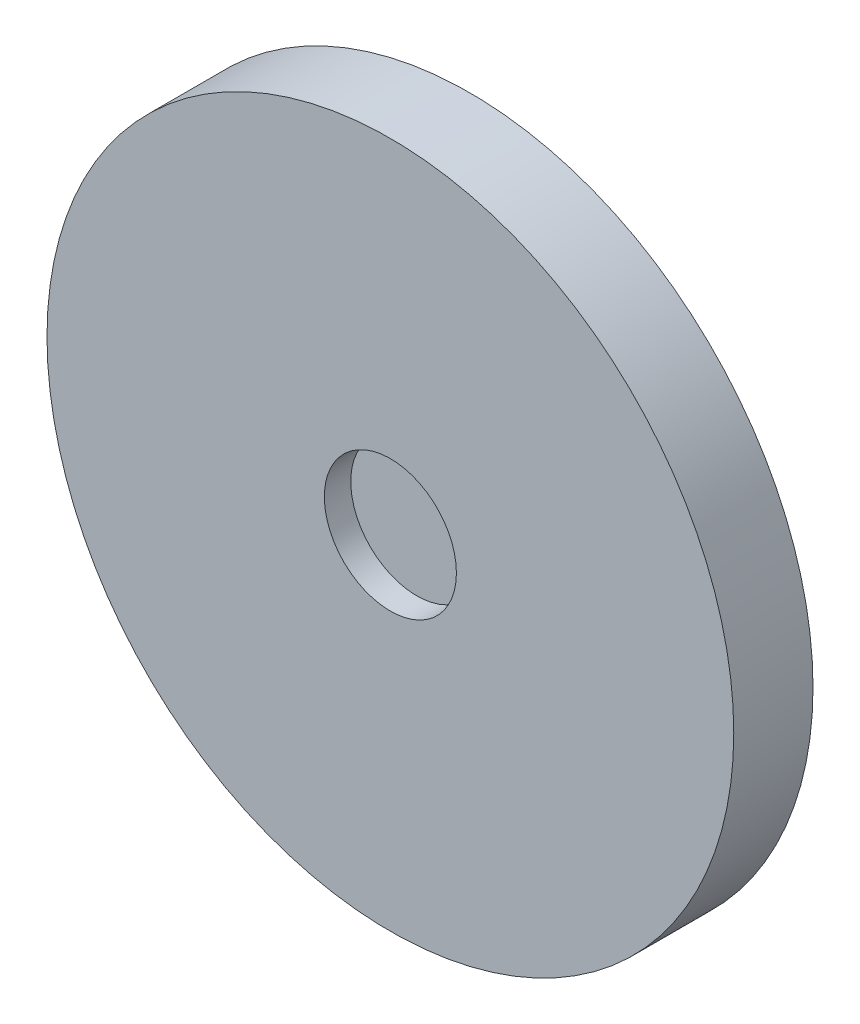
ISO-10303-21;
HEADER;
FILE_DESCRIPTION(('STEP AP214'),'2;1');
FILE_NAME('part.step','',(''),(''),'','','');
FILE_SCHEMA(('AUTOMOTIVE_DESIGN { 1 0 10303 214 1 1 1 1 }'));
ENDSEC;
DATA;
#1=APPLICATION_CONTEXT('core data for automotive mechanical design processes');
#2=APPLICATION_PROTOCOL_DEFINITION('international standard','automotive_design',2000,#1);
#3=PRODUCT_CONTEXT('',#1,'mechanical');
#4=PRODUCT('Part','Part','',(#3));
#5=PRODUCT_RELATED_PRODUCT_CATEGORY('part','',(#4));
#6=PRODUCT_DEFINITION_FORMATION('','',#4);
#7=PRODUCT_DEFINITION_CONTEXT('part definition',#1,'design');
#8=PRODUCT_DEFINITION('design','',#6,#7);
#9=PRODUCT_DEFINITION_SHAPE('','',#8);
#10=(LENGTH_UNIT() NAMED_UNIT(*) SI_UNIT(.MILLI.,.METRE.));
#11=(NAMED_UNIT(*) PLANE_ANGLE_UNIT() SI_UNIT($,.RADIAN.));
#12=(NAMED_UNIT(*) SI_UNIT($,.STERADIAN.) SOLID_ANGLE_UNIT());
#13=UNCERTAINTY_MEASURE_WITH_UNIT(LENGTH_MEASURE(1.E-05),#10,'distance_accuracy_value','');
#14=(GEOMETRIC_REPRESENTATION_CONTEXT(3) GLOBAL_UNCERTAINTY_ASSIGNED_CONTEXT((#13)) GLOBAL_UNIT_ASSIGNED_CONTEXT((#10,
#11,#12)) REPRESENTATION_CONTEXT('',''));
#15=CARTESIAN_POINT('',(0.,0.,0.));
#16=DIRECTION('',(0.,0.,1.));
#17=DIRECTION('',(1.,0.,0.));
#18=AXIS2_PLACEMENT_3D('',#15,#16,#17);
#19=CARTESIAN_POINT('',(0.,0.,0.9));
#20=DIRECTION('',(0.,0.,-1.));
#21=DIRECTION('',(-1.,0.,0.));
#22=AXIS2_PLACEMENT_3D('',#19,#20,#21);
#23=CYLINDRICAL_SURFACE('',#22,3.9);
#24=CARTESIAN_POINT('',(0.,0.,0.9));
#25=DIRECTION('',(0.,0.,1.));
#26=DIRECTION('',(1.,0.,0.));
#27=AXIS2_PLACEMENT_3D('',#24,#25,#26);
#28=CIRCLE('',#27,3.9);
#29=CARTESIAN_POINT('',(3.9,0.,0.9));
#30=VERTEX_POINT('',#29);
#31=EDGE_CURVE('E10',#30,#30,#28,.T.);
#32=ORIENTED_EDGE('',*,*,#31,.F.);
#33=EDGE_LOOP('',(#32));
#34=FACE_BOUND('',#33,.T.);
#35=CARTESIAN_POINT('',(0.,0.,0.));
#36=DIRECTION('',(0.,0.,1.));
#37=DIRECTION('',(1.,0.,0.));
#38=AXIS2_PLACEMENT_3D('',#35,#36,#37);
#39=CIRCLE('',#38,3.9);
#40=CARTESIAN_POINT('',(3.9,0.,0.));
#41=VERTEX_POINT('',#40);
#42=EDGE_CURVE('E35',#41,#41,#39,.T.);
#43=ORIENTED_EDGE('',*,*,#42,.T.);
#44=EDGE_LOOP('',(#43));
#45=FACE_BOUND('',#44,.T.);
#46=ADVANCED_FACE('F32',(#34,#45),#23,.T.);
#47=CARTESIAN_POINT('',(0.,0.,0.9));
#48=DIRECTION('',(0.,0.,1.));
#49=DIRECTION('',(1.,0.,0.));
#50=AXIS2_PLACEMENT_3D('',#47,#48,#49);
#51=PLANE('',#50);
#52=CARTESIAN_POINT('',(0.,0.,0.9));
#53=DIRECTION('',(0.,0.,1.));
#54=DIRECTION('',(1.,0.,0.));
#55=AXIS2_PLACEMENT_3D('',#52,#53,#54);
#56=CIRCLE('',#55,0.75);
#57=CARTESIAN_POINT('',(0.75,0.,0.9));
#58=VERTEX_POINT('',#57);
#59=EDGE_CURVE('E44',#58,#58,#56,.T.);
#60=ORIENTED_EDGE('',*,*,#59,.F.);
#61=EDGE_LOOP('',(#60));
#62=FACE_BOUND('',#61,.T.);
#63=ORIENTED_EDGE('',*,*,#31,.T.);
#64=EDGE_LOOP('',(#63));
#65=FACE_BOUND('',#64,.T.);
#66=ADVANCED_FACE('F59',(#62,#65),#51,.T.);
#67=CARTESIAN_POINT('',(0.,0.,0.));
#68=DIRECTION('',(0.,0.,1.));
#69=DIRECTION('',(1.,0.,0.));
#70=AXIS2_PLACEMENT_3D('',#67,#68,#69);
#71=PLANE('',#70);
#72=ORIENTED_EDGE('',*,*,#42,.F.);
#73=EDGE_LOOP('',(#72));
#74=FACE_BOUND('',#73,.T.);
#75=ADVANCED_FACE('F55',(#74),#71,.F.);
#76=CARTESIAN_POINT('',(0.,0.,0.6));
#77=DIRECTION('',(0.,0.,1.));
#78=DIRECTION('',(1.,0.,0.));
#79=AXIS2_PLACEMENT_3D('',#76,#77,#78);
#80=CYLINDRICAL_SURFACE('',#79,0.75);
#81=CARTESIAN_POINT('',(0.,0.,0.6));
#82=DIRECTION('',(0.,0.,1.));
#83=DIRECTION('',(1.,0.,0.));
#84=AXIS2_PLACEMENT_3D('',#81,#82,#83);
#85=CIRCLE('',#84,0.75);
#86=CARTESIAN_POINT('',(0.75,0.,0.6));
#87=VERTEX_POINT('',#86);
#88=EDGE_CURVE('E42',#87,#87,#85,.T.);
#89=ORIENTED_EDGE('',*,*,#88,.F.);
#90=EDGE_LOOP('',(#89));
#91=FACE_BOUND('',#90,.T.);
#92=ORIENTED_EDGE('',*,*,#59,.T.);
#93=EDGE_LOOP('',(#92));
#94=FACE_BOUND('',#93,.T.);
#95=ADVANCED_FACE('F52',(#91,#94),#80,.F.);
#96=CARTESIAN_POINT('',(0.,0.,0.6));
#97=DIRECTION('',(0.,0.,1.));
#98=DIRECTION('',(1.,0.,0.));
#99=AXIS2_PLACEMENT_3D('',#96,#97,#98);
#100=PLANE('',#99);
#101=ORIENTED_EDGE('',*,*,#88,.T.);
#102=EDGE_LOOP('',(#101));
#103=FACE_BOUND('',#102,.T.);
#104=ADVANCED_FACE('F50',(#103),#100,.T.);
#105=CLOSED_SHELL('',(#46,#66,#75,#95,#104));
#106=MANIFOLD_SOLID_BREP('B2',#105);
#107=ADVANCED_BREP_SHAPE_REPRESENTATION('',(#18,#106),#14);
#108=SHAPE_DEFINITION_REPRESENTATION(#9,#107);
ENDSEC;
END-ISO-10303-21;
